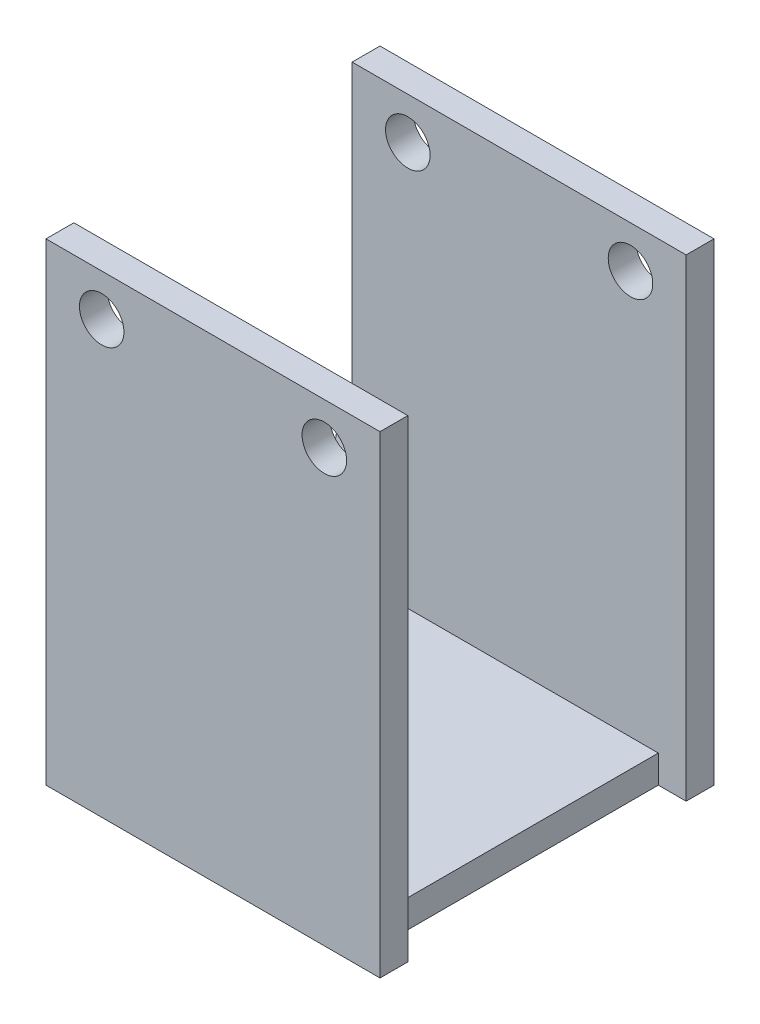
ISO-10303-21;
HEADER;
FILE_DESCRIPTION(('STEP AP214'),'2;1');
FILE_NAME('part.step','',(''),(''),'','','');
FILE_SCHEMA(('AUTOMOTIVE_DESIGN { 1 0 10303 214 1 1 1 1 }'));
ENDSEC;
DATA;
#1=APPLICATION_CONTEXT('core data for automotive mechanical design processes');
#2=APPLICATION_PROTOCOL_DEFINITION('international standard','automotive_design',2000,#1);
#3=PRODUCT_CONTEXT('',#1,'mechanical');
#4=PRODUCT('Part','Part','',(#3));
#5=PRODUCT_RELATED_PRODUCT_CATEGORY('part','',(#4));
#6=PRODUCT_DEFINITION_FORMATION('','',#4);
#7=PRODUCT_DEFINITION_CONTEXT('part definition',#1,'design');
#8=PRODUCT_DEFINITION('design','',#6,#7);
#9=PRODUCT_DEFINITION_SHAPE('','',#8);
#10=(LENGTH_UNIT() NAMED_UNIT(*) SI_UNIT(.MILLI.,.METRE.));
#11=(NAMED_UNIT(*) PLANE_ANGLE_UNIT() SI_UNIT($,.RADIAN.));
#12=(NAMED_UNIT(*) SI_UNIT($,.STERADIAN.) SOLID_ANGLE_UNIT());
#13=UNCERTAINTY_MEASURE_WITH_UNIT(LENGTH_MEASURE(1.E-05),#10,'distance_accuracy_value','');
#14=(GEOMETRIC_REPRESENTATION_CONTEXT(3) GLOBAL_UNCERTAINTY_ASSIGNED_CONTEXT((#13)) GLOBAL_UNIT_ASSIGNED_CONTEXT((#10,
#11,#12)) REPRESENTATION_CONTEXT('',''));
#15=CARTESIAN_POINT('',(0.,0.,0.));
#16=DIRECTION('',(0.,0.,1.));
#17=DIRECTION('',(1.,0.,0.));
#18=AXIS2_PLACEMENT_3D('',#15,#16,#17);
#19=CARTESIAN_POINT('',(0.,0.,1.));
#20=DIRECTION('',(0.,0.,-1.));
#21=DIRECTION('',(-1.,0.,0.));
#22=AXIS2_PLACEMENT_3D('',#19,#20,#21);
#23=PLANE('',#22);
#24=CARTESIAN_POINT('',(9.,15.5,1.));
#25=DIRECTION('',(0.,0.,-1.));
#26=DIRECTION('',(-1.,0.,0.));
#27=AXIS2_PLACEMENT_3D('',#24,#25,#26);
#28=CIRCLE('',#27,0.799999999999998);
#29=CARTESIAN_POINT('',(8.2,15.5,1.));
#30=VERTEX_POINT('',#29);
#31=EDGE_CURVE('E211',#30,#30,#28,.F.);
#32=ORIENTED_EDGE('',*,*,#31,.F.);
#33=EDGE_LOOP('',(#32));
#34=FACE_BOUND('',#33,.T.);
#35=DIRECTION('',(0.,-1.,0.));
#36=VECTOR('',#35,1.);
#37=CARTESIAN_POINT('',(-1.,0.,1.));
#38=LINE('',#37,#36);
#39=CARTESIAN_POINT('',(-1.,17.,1.));
#40=VERTEX_POINT('',#39);
#41=CARTESIAN_POINT('',(-1.,0.,1.));
#42=VERTEX_POINT('',#41);
#43=EDGE_CURVE('E226',#40,#42,#38,.T.);
#44=ORIENTED_EDGE('',*,*,#43,.T.);
#45=DIRECTION('',(1.,0.,0.));
#46=VECTOR('',#45,1.);
#47=CARTESIAN_POINT('',(-1.,0.,1.));
#48=LINE('',#47,#46);
#49=CARTESIAN_POINT('',(11.,0.,1.));
#50=VERTEX_POINT('',#49);
#51=EDGE_CURVE('E398',#42,#50,#48,.T.);
#52=ORIENTED_EDGE('',*,*,#51,.T.);
#53=DIRECTION('',(0.,1.,0.));
#54=VECTOR('',#53,1.);
#55=CARTESIAN_POINT('',(11.,0.,1.));
#56=LINE('',#55,#54);
#57=CARTESIAN_POINT('',(11.,17.,1.));
#58=VERTEX_POINT('',#57);
#59=EDGE_CURVE('E397',#50,#58,#56,.T.);
#60=ORIENTED_EDGE('',*,*,#59,.T.);
#61=DIRECTION('',(-1.,0.,0.));
#62=VECTOR('',#61,1.);
#63=CARTESIAN_POINT('',(-1.,17.,1.));
#64=LINE('',#63,#62);
#65=EDGE_CURVE('E373',#58,#40,#64,.T.);
#66=ORIENTED_EDGE('',*,*,#65,.T.);
#67=EDGE_LOOP('',(#44,#52,#60,#66));
#68=FACE_BOUND('',#67,.T.);
#69=CARTESIAN_POINT('',(1.,15.5,1.));
#70=DIRECTION('',(0.,0.,-1.));
#71=DIRECTION('',(-1.,0.,0.));
#72=AXIS2_PLACEMENT_3D('',#69,#70,#71);
#73=CIRCLE('',#72,0.799999999999998);
#74=CARTESIAN_POINT('',(0.200000000000003,15.5,1.));
#75=VERTEX_POINT('',#74);
#76=EDGE_CURVE('E202',#75,#75,#73,.F.);
#77=ORIENTED_EDGE('',*,*,#76,.F.);
#78=EDGE_LOOP('',(#77));
#79=FACE_BOUND('',#78,.T.);
#80=ADVANCED_FACE('F39',(#34,#68,#79),#23,.F.);
#81=CARTESIAN_POINT('',(10.,1.,0.));
#82=DIRECTION('',(-1.,0.,0.));
#83=DIRECTION('',(0.,0.,1.));
#84=AXIS2_PLACEMENT_3D('',#81,#82,#83);
#85=PLANE('',#84);
#86=DIRECTION('',(0.,0.,-1.));
#87=VECTOR('',#86,1.);
#88=CARTESIAN_POINT('',(10.,0.,0.));
#89=LINE('',#88,#87);
#90=CARTESIAN_POINT('',(10.,0.,0.));
#91=VERTEX_POINT('',#90);
#92=CARTESIAN_POINT('',(10.,0.,-10.));
#93=VERTEX_POINT('',#92);
#94=EDGE_CURVE('E292',#91,#93,#89,.T.);
#95=ORIENTED_EDGE('',*,*,#94,.T.);
#96=DIRECTION('',(0.,-1.,0.));
#97=VECTOR('',#96,1.);
#98=CARTESIAN_POINT('',(10.,1.,-10.));
#99=LINE('',#98,#97);
#100=CARTESIAN_POINT('',(10.,1.,-10.));
#101=VERTEX_POINT('',#100);
#102=EDGE_CURVE('E48',#101,#93,#99,.T.);
#103=ORIENTED_EDGE('',*,*,#102,.F.);
#104=DIRECTION('',(0.,0.,-1.));
#105=VECTOR('',#104,1.);
#106=CARTESIAN_POINT('',(10.,1.,0.));
#107=LINE('',#106,#105);
#108=CARTESIAN_POINT('',(10.,1.,0.));
#109=VERTEX_POINT('',#108);
#110=EDGE_CURVE('E56',#109,#101,#107,.T.);
#111=ORIENTED_EDGE('',*,*,#110,.F.);
#112=DIRECTION('',(0.,-1.,0.));
#113=VECTOR('',#112,1.);
#114=CARTESIAN_POINT('',(10.,1.,0.));
#115=LINE('',#114,#113);
#116=EDGE_CURVE('E11',#109,#91,#115,.T.);
#117=ORIENTED_EDGE('',*,*,#116,.T.);
#118=EDGE_LOOP('',(#95,#103,#111,#117));
#119=FACE_BOUND('',#118,.T.);
#120=ADVANCED_FACE('F41',(#119),#85,.F.);
#121=CARTESIAN_POINT('',(0.,1.,0.));
#122=DIRECTION('',(0.,-1.,0.));
#123=DIRECTION('',(0.,0.,-1.));
#124=AXIS2_PLACEMENT_3D('',#121,#122,#123);
#125=PLANE('',#124);
#126=DIRECTION('',(0.,0.,1.));
#127=VECTOR('',#126,1.);
#128=CARTESIAN_POINT('',(0.,1.,0.));
#129=LINE('',#128,#127);
#130=CARTESIAN_POINT('',(0.,0.999999999999999,-10.));
#131=VERTEX_POINT('',#130);
#132=CARTESIAN_POINT('',(0.,0.999999999999999,0.));
#133=VERTEX_POINT('',#132);
#134=EDGE_CURVE('E64',#131,#133,#129,.T.);
#135=ORIENTED_EDGE('',*,*,#134,.T.);
#136=DIRECTION('',(1.,0.,0.));
#137=VECTOR('',#136,1.);
#138=CARTESIAN_POINT('',(0.,1.,0.));
#139=LINE('',#138,#137);
#140=EDGE_CURVE('E299',#133,#109,#139,.T.);
#141=ORIENTED_EDGE('',*,*,#140,.T.);
#142=ORIENTED_EDGE('',*,*,#110,.T.);
#143=DIRECTION('',(-1.,0.,0.));
#144=VECTOR('',#143,1.);
#145=CARTESIAN_POINT('',(0.,1.,-10.));
#146=LINE('',#145,#144);
#147=EDGE_CURVE('E311',#101,#131,#146,.T.);
#148=ORIENTED_EDGE('',*,*,#147,.T.);
#149=EDGE_LOOP('',(#135,#141,#142,#148));
#150=FACE_BOUND('',#149,.T.);
#151=ADVANCED_FACE('F286',(#150),#125,.F.);
#152=CARTESIAN_POINT('',(0.,0.,0.));
#153=DIRECTION('',(0.,-1.,0.));
#154=DIRECTION('',(0.,0.,-1.));
#155=AXIS2_PLACEMENT_3D('',#152,#153,#154);
#156=PLANE('',#155);
#157=ORIENTED_EDGE('',*,*,#94,.F.);
#158=DIRECTION('',(1.,0.,0.));
#159=VECTOR('',#158,1.);
#160=CARTESIAN_POINT('',(-1.,0.,0.));
#161=LINE('',#160,#159);
#162=CARTESIAN_POINT('',(11.,0.,0.));
#163=VERTEX_POINT('',#162);
#164=EDGE_CURVE('E172',#91,#163,#161,.T.);
#165=ORIENTED_EDGE('',*,*,#164,.T.);
#166=DIRECTION('',(0.,0.,-1.));
#167=VECTOR('',#166,1.);
#168=CARTESIAN_POINT('',(11.,0.,1.));
#169=LINE('',#168,#167);
#170=EDGE_CURVE('E375',#50,#163,#169,.T.);
#171=ORIENTED_EDGE('',*,*,#170,.F.);
#172=ORIENTED_EDGE('',*,*,#51,.F.);
#173=DIRECTION('',(0.,0.,1.));
#174=VECTOR('',#173,1.);
#175=CARTESIAN_POINT('',(-1.,0.,0.));
#176=LINE('',#175,#174);
#177=CARTESIAN_POINT('',(-0.999999999999999,0.,-11.));
#178=VERTEX_POINT('',#177);
#179=EDGE_CURVE('E355',#178,#42,#176,.T.);
#180=ORIENTED_EDGE('',*,*,#179,.F.);
#181=DIRECTION('',(-1.,0.,0.));
#182=VECTOR('',#181,1.);
#183=CARTESIAN_POINT('',(11.,0.,-11.));
#184=LINE('',#183,#182);
#185=CARTESIAN_POINT('',(11.,0.,-11.));
#186=VERTEX_POINT('',#185);
#187=EDGE_CURVE('E161',#186,#178,#184,.T.);
#188=ORIENTED_EDGE('',*,*,#187,.F.);
#189=DIRECTION('',(0.,0.,1.));
#190=VECTOR('',#189,1.);
#191=CARTESIAN_POINT('',(11.,0.,-11.));
#192=LINE('',#191,#190);
#193=CARTESIAN_POINT('',(11.,0.,-10.));
#194=VERTEX_POINT('',#193);
#195=EDGE_CURVE('E174',#186,#194,#192,.T.);
#196=ORIENTED_EDGE('',*,*,#195,.T.);
#197=DIRECTION('',(-1.,0.,0.));
#198=VECTOR('',#197,1.);
#199=CARTESIAN_POINT('',(11.,0.,-10.));
#200=LINE('',#199,#198);
#201=EDGE_CURVE('E163',#194,#93,#200,.T.);
#202=ORIENTED_EDGE('',*,*,#201,.T.);
#203=EDGE_LOOP('',(#157,#165,#171,#172,#180,#188,#196,#202));
#204=FACE_BOUND('',#203,.T.);
#205=ADVANCED_FACE('F284',(#204),#156,.T.);
#206=CARTESIAN_POINT('',(-1.,6.5,0.));
#207=DIRECTION('',(0.,-1.,0.));
#208=DIRECTION('',(0.,0.,-1.));
#209=AXIS2_PLACEMENT_3D('',#206,#207,#208);
#210=PLANE('',#209);
#211=DIRECTION('',(0.,0.,-1.));
#212=VECTOR('',#211,1.);
#213=CARTESIAN_POINT('',(0.,6.5,0.));
#214=LINE('',#213,#212);
#215=CARTESIAN_POINT('',(0.,6.5,0.));
#216=VERTEX_POINT('',#215);
#217=CARTESIAN_POINT('',(0.,6.5,-0.5));
#218=VERTEX_POINT('',#217);
#219=EDGE_CURVE('E351',#216,#218,#214,.T.);
#220=ORIENTED_EDGE('',*,*,#219,.T.);
#221=DIRECTION('',(1.,0.,0.));
#222=VECTOR('',#221,1.);
#223=CARTESIAN_POINT('',(-1.,6.5,-0.5));
#224=LINE('',#223,#222);
#225=CARTESIAN_POINT('',(-1.,6.5,-0.5));
#226=VERTEX_POINT('',#225);
#227=EDGE_CURVE('E302',#226,#218,#224,.T.);
#228=ORIENTED_EDGE('',*,*,#227,.F.);
#229=DIRECTION('',(0.,0.,-1.));
#230=VECTOR('',#229,1.);
#231=CARTESIAN_POINT('',(-1.,6.5,0.));
#232=LINE('',#231,#230);
#233=CARTESIAN_POINT('',(-1.,6.5,0.));
#234=VERTEX_POINT('',#233);
#235=EDGE_CURVE('E329',#234,#226,#232,.T.);
#236=ORIENTED_EDGE('',*,*,#235,.F.);
#237=DIRECTION('',(1.,0.,0.));
#238=VECTOR('',#237,1.);
#239=CARTESIAN_POINT('',(-1.,6.5,0.));
#240=LINE('',#239,#238);
#241=EDGE_CURVE('E297',#234,#216,#240,.T.);
#242=ORIENTED_EDGE('',*,*,#241,.T.);
#243=EDGE_LOOP('',(#220,#228,#236,#242));
#244=FACE_BOUND('',#243,.T.);
#245=ADVANCED_FACE('F280',(#244),#210,.F.);
#246=CARTESIAN_POINT('',(-1.,6.5,-5.));
#247=DIRECTION('',(1.,0.,0.));
#248=DIRECTION('',(0.,0.,-1.));
#249=AXIS2_PLACEMENT_3D('',#246,#247,#248);
#250=CYLINDRICAL_SURFACE('',#249,4.5);
#251=CARTESIAN_POINT('',(0.,6.5,-5.));
#252=DIRECTION('',(1.,0.,0.));
#253=DIRECTION('',(0.,0.,1.));
#254=AXIS2_PLACEMENT_3D('',#251,#252,#253);
#255=CIRCLE('',#254,4.5);
#256=CARTESIAN_POINT('',(0.,6.5,-9.5));
#257=VERTEX_POINT('',#256);
#258=EDGE_CURVE('E346',#218,#257,#255,.T.);
#259=ORIENTED_EDGE('',*,*,#258,.T.);
#260=DIRECTION('',(1.,0.,0.));
#261=VECTOR('',#260,1.);
#262=CARTESIAN_POINT('',(-1.,6.5,-9.5));
#263=LINE('',#262,#261);
#264=CARTESIAN_POINT('',(-1.,6.5,-9.5));
#265=VERTEX_POINT('',#264);
#266=EDGE_CURVE('E338',#265,#257,#263,.T.);
#267=ORIENTED_EDGE('',*,*,#266,.F.);
#268=CARTESIAN_POINT('',(-1.,6.5,-5.));
#269=DIRECTION('',(1.,0.,0.));
#270=DIRECTION('',(0.,0.,1.));
#271=AXIS2_PLACEMENT_3D('',#268,#269,#270);
#272=CIRCLE('',#271,4.5);
#273=EDGE_CURVE('E347',#226,#265,#272,.T.);
#274=ORIENTED_EDGE('',*,*,#273,.F.);
#275=ORIENTED_EDGE('',*,*,#227,.T.);
#276=EDGE_LOOP('',(#259,#267,#274,#275));
#277=FACE_BOUND('',#276,.T.);
#278=ADVANCED_FACE('F276',(#277),#250,.F.);
#279=CARTESIAN_POINT('',(-1.,6.5,-9.5));
#280=DIRECTION('',(0.,-1.,0.));
#281=DIRECTION('',(0.,0.,-1.));
#282=AXIS2_PLACEMENT_3D('',#279,#280,#281);
#283=PLANE('',#282);
#284=DIRECTION('',(0.,0.,-1.));
#285=VECTOR('',#284,1.);
#286=CARTESIAN_POINT('',(0.,6.5,-9.5));
#287=LINE('',#286,#285);
#288=CARTESIAN_POINT('',(0.,6.5,-10.));
#289=VERTEX_POINT('',#288);
#290=EDGE_CURVE('E330',#257,#289,#287,.T.);
#291=ORIENTED_EDGE('',*,*,#290,.T.);
#292=DIRECTION('',(1.,0.,0.));
#293=VECTOR('',#292,1.);
#294=CARTESIAN_POINT('',(-1.,6.5,-10.));
#295=LINE('',#294,#293);
#296=CARTESIAN_POINT('',(-1.,6.5,-10.));
#297=VERTEX_POINT('',#296);
#298=EDGE_CURVE('E340',#297,#289,#295,.T.);
#299=ORIENTED_EDGE('',*,*,#298,.F.);
#300=DIRECTION('',(0.,0.,-1.));
#301=VECTOR('',#300,1.);
#302=CARTESIAN_POINT('',(-1.,6.5,-9.5));
#303=LINE('',#302,#301);
#304=EDGE_CURVE('E312',#265,#297,#303,.T.);
#305=ORIENTED_EDGE('',*,*,#304,.F.);
#306=ORIENTED_EDGE('',*,*,#266,.T.);
#307=EDGE_LOOP('',(#291,#299,#305,#306));
#308=FACE_BOUND('',#307,.T.);
#309=ADVANCED_FACE('F271',(#308),#283,.F.);
#310=CARTESIAN_POINT('',(-1.,6.5,-5.));
#311=DIRECTION('',(-1.,0.,0.));
#312=DIRECTION('',(0.,0.,1.));
#313=AXIS2_PLACEMENT_3D('',#310,#311,#312);
#314=PLANE('',#313);
#315=ORIENTED_EDGE('',*,*,#179,.T.);
#316=ORIENTED_EDGE('',*,*,#43,.F.);
#317=DIRECTION('',(0.,0.,-1.));
#318=VECTOR('',#317,1.);
#319=CARTESIAN_POINT('',(-1.,17.,1.));
#320=LINE('',#319,#318);
#321=CARTESIAN_POINT('',(-1.,17.,0.));
#322=VERTEX_POINT('',#321);
#323=EDGE_CURVE('E369',#40,#322,#320,.T.);
#324=ORIENTED_EDGE('',*,*,#323,.T.);
#325=DIRECTION('',(0.,-1.,0.));
#326=VECTOR('',#325,1.);
#327=CARTESIAN_POINT('',(-1.,0.,0.));
#328=LINE('',#327,#326);
#329=EDGE_CURVE('E169',#322,#234,#328,.T.);
#330=ORIENTED_EDGE('',*,*,#329,.T.);
#331=ORIENTED_EDGE('',*,*,#235,.T.);
#332=ORIENTED_EDGE('',*,*,#273,.T.);
#333=ORIENTED_EDGE('',*,*,#304,.T.);
#334=DIRECTION('',(0.,1.,0.));
#335=VECTOR('',#334,1.);
#336=CARTESIAN_POINT('',(-0.999999999999999,0.,-10.));
#337=LINE('',#336,#335);
#338=CARTESIAN_POINT('',(-0.999999999999999,17.,-10.));
#339=VERTEX_POINT('',#338);
#340=EDGE_CURVE('E167',#297,#339,#337,.T.);
#341=ORIENTED_EDGE('',*,*,#340,.T.);
#342=DIRECTION('',(0.,0.,1.));
#343=VECTOR('',#342,1.);
#344=CARTESIAN_POINT('',(-0.999999999999999,17.,-11.));
#345=LINE('',#344,#343);
#346=CARTESIAN_POINT('',(-0.999999999999999,17.,-11.));
#347=VERTEX_POINT('',#346);
#348=EDGE_CURVE('E149',#347,#339,#345,.T.);
#349=ORIENTED_EDGE('',*,*,#348,.F.);
#350=DIRECTION('',(0.,1.,0.));
#351=VECTOR('',#350,1.);
#352=CARTESIAN_POINT('',(-0.999999999999999,0.,-11.));
#353=LINE('',#352,#351);
#354=EDGE_CURVE('E155',#178,#347,#353,.T.);
#355=ORIENTED_EDGE('',*,*,#354,.F.);
#356=EDGE_LOOP('',(#315,#316,#324,#330,#331,#332,#333,#341,#349,#355));
#357=FACE_BOUND('',#356,.T.);
#358=ADVANCED_FACE('F165',(#357),#314,.T.);
#359=CARTESIAN_POINT('',(0.,6.5,-5.));
#360=DIRECTION('',(-1.,0.,0.));
#361=DIRECTION('',(0.,0.,1.));
#362=AXIS2_PLACEMENT_3D('',#359,#360,#361);
#363=PLANE('',#362);
#364=ORIENTED_EDGE('',*,*,#134,.F.);
#365=DIRECTION('',(0.,-1.,0.));
#366=VECTOR('',#365,1.);
#367=CARTESIAN_POINT('',(0.,0.,-10.));
#368=LINE('',#367,#366);
#369=EDGE_CURVE('E325',#289,#131,#368,.T.);
#370=ORIENTED_EDGE('',*,*,#369,.F.);
#371=ORIENTED_EDGE('',*,*,#290,.F.);
#372=ORIENTED_EDGE('',*,*,#258,.F.);
#373=ORIENTED_EDGE('',*,*,#219,.F.);
#374=DIRECTION('',(0.,1.,0.));
#375=VECTOR('',#374,1.);
#376=CARTESIAN_POINT('',(0.,0.,0.));
#377=LINE('',#376,#375);
#378=EDGE_CURVE('E331',#133,#216,#377,.T.);
#379=ORIENTED_EDGE('',*,*,#378,.F.);
#380=EDGE_LOOP('',(#364,#370,#371,#372,#373,#379));
#381=FACE_BOUND('',#380,.T.);
#382=ADVANCED_FACE('F261',(#381),#363,.F.);
#383=CARTESIAN_POINT('',(0.,0.,0.));
#384=DIRECTION('',(0.,0.,-1.));
#385=DIRECTION('',(-1.,0.,0.));
#386=AXIS2_PLACEMENT_3D('',#383,#384,#385);
#387=PLANE('',#386);
#388=CARTESIAN_POINT('',(9.,15.5,0.));
#389=DIRECTION('',(0.,0.,-1.));
#390=DIRECTION('',(-1.,0.,0.));
#391=AXIS2_PLACEMENT_3D('',#388,#389,#390);
#392=CIRCLE('',#391,0.799999999999998);
#393=CARTESIAN_POINT('',(8.2,15.5,0.));
#394=VERTEX_POINT('',#393);
#395=EDGE_CURVE('E203',#394,#394,#392,.T.);
#396=ORIENTED_EDGE('',*,*,#395,.F.);
#397=EDGE_LOOP('',(#396));
#398=FACE_BOUND('',#397,.T.);
#399=CARTESIAN_POINT('',(1.,15.5,0.));
#400=DIRECTION('',(0.,0.,-1.));
#401=DIRECTION('',(-1.,0.,0.));
#402=AXIS2_PLACEMENT_3D('',#399,#400,#401);
#403=CIRCLE('',#402,0.799999999999998);
#404=CARTESIAN_POINT('',(0.200000000000003,15.5,0.));
#405=VERTEX_POINT('',#404);
#406=EDGE_CURVE('E181',#405,#405,#403,.T.);
#407=ORIENTED_EDGE('',*,*,#406,.F.);
#408=EDGE_LOOP('',(#407));
#409=FACE_BOUND('',#408,.T.);
#410=ORIENTED_EDGE('',*,*,#116,.F.);
#411=ORIENTED_EDGE('',*,*,#140,.F.);
#412=ORIENTED_EDGE('',*,*,#378,.T.);
#413=ORIENTED_EDGE('',*,*,#241,.F.);
#414=ORIENTED_EDGE('',*,*,#329,.F.);
#415=DIRECTION('',(-1.,0.,0.));
#416=VECTOR('',#415,1.);
#417=CARTESIAN_POINT('',(-1.,17.,0.));
#418=LINE('',#417,#416);
#419=CARTESIAN_POINT('',(11.,17.,0.));
#420=VERTEX_POINT('',#419);
#421=EDGE_CURVE('E367',#420,#322,#418,.T.);
#422=ORIENTED_EDGE('',*,*,#421,.F.);
#423=DIRECTION('',(0.,1.,0.));
#424=VECTOR('',#423,1.);
#425=CARTESIAN_POINT('',(11.,0.,0.));
#426=LINE('',#425,#424);
#427=EDGE_CURVE('E359',#163,#420,#426,.T.);
#428=ORIENTED_EDGE('',*,*,#427,.F.);
#429=ORIENTED_EDGE('',*,*,#164,.F.);
#430=EDGE_LOOP('',(#410,#411,#412,#413,#414,#422,#428,#429));
#431=FACE_BOUND('',#430,.T.);
#432=ADVANCED_FACE('F257',(#398,#409,#431),#387,.T.);
#433=CARTESIAN_POINT('',(11.,0.,1.));
#434=DIRECTION('',(-1.,0.,0.));
#435=DIRECTION('',(0.,0.,1.));
#436=AXIS2_PLACEMENT_3D('',#433,#434,#435);
#437=PLANE('',#436);
#438=ORIENTED_EDGE('',*,*,#427,.T.);
#439=DIRECTION('',(0.,0.,-1.));
#440=VECTOR('',#439,1.);
#441=CARTESIAN_POINT('',(11.,17.,1.));
#442=LINE('',#441,#440);
#443=EDGE_CURVE('E372',#58,#420,#442,.T.);
#444=ORIENTED_EDGE('',*,*,#443,.F.);
#445=ORIENTED_EDGE('',*,*,#59,.F.);
#446=ORIENTED_EDGE('',*,*,#170,.T.);
#447=EDGE_LOOP('',(#438,#444,#445,#446));
#448=FACE_BOUND('',#447,.T.);
#449=ADVANCED_FACE('F260',(#448),#437,.F.);
#450=CARTESIAN_POINT('',(-1.,17.,1.));
#451=DIRECTION('',(0.,-1.,0.));
#452=DIRECTION('',(0.,0.,-1.));
#453=AXIS2_PLACEMENT_3D('',#450,#451,#452);
#454=PLANE('',#453);
#455=ORIENTED_EDGE('',*,*,#421,.T.);
#456=ORIENTED_EDGE('',*,*,#323,.F.);
#457=ORIENTED_EDGE('',*,*,#65,.F.);
#458=ORIENTED_EDGE('',*,*,#443,.T.);
#459=EDGE_LOOP('',(#455,#456,#457,#458));
#460=FACE_BOUND('',#459,.T.);
#461=ADVANCED_FACE('F250',(#460),#454,.F.);
#462=CARTESIAN_POINT('',(0.,0.,-10.));
#463=DIRECTION('',(0.,0.,-1.));
#464=DIRECTION('',(-1.,0.,0.));
#465=AXIS2_PLACEMENT_3D('',#462,#463,#464);
#466=PLANE('',#465);
#467=CARTESIAN_POINT('',(9.,15.5,-10.));
#468=DIRECTION('',(0.,0.,-1.));
#469=DIRECTION('',(-1.,0.,0.));
#470=AXIS2_PLACEMENT_3D('',#467,#468,#469);
#471=CIRCLE('',#470,0.799999999999998);
#472=CARTESIAN_POINT('',(8.2,15.5,-10.));
#473=VERTEX_POINT('',#472);
#474=EDGE_CURVE('E208',#473,#473,#471,.T.);
#475=ORIENTED_EDGE('',*,*,#474,.T.);
#476=EDGE_LOOP('',(#475));
#477=FACE_BOUND('',#476,.T.);
#478=CARTESIAN_POINT('',(1.,15.5,-10.));
#479=DIRECTION('',(0.,0.,-1.));
#480=DIRECTION('',(-1.,0.,0.));
#481=AXIS2_PLACEMENT_3D('',#478,#479,#480);
#482=CIRCLE('',#481,0.799999999999998);
#483=CARTESIAN_POINT('',(0.200000000000003,15.5,-10.));
#484=VERTEX_POINT('',#483);
#485=EDGE_CURVE('E43',#484,#484,#482,.T.);
#486=ORIENTED_EDGE('',*,*,#485,.T.);
#487=EDGE_LOOP('',(#486));
#488=FACE_BOUND('',#487,.T.);
#489=ORIENTED_EDGE('',*,*,#340,.F.);
#490=ORIENTED_EDGE('',*,*,#298,.T.);
#491=ORIENTED_EDGE('',*,*,#369,.T.);
#492=ORIENTED_EDGE('',*,*,#147,.F.);
#493=ORIENTED_EDGE('',*,*,#102,.T.);
#494=ORIENTED_EDGE('',*,*,#201,.F.);
#495=DIRECTION('',(0.,-1.,0.));
#496=VECTOR('',#495,1.);
#497=CARTESIAN_POINT('',(11.,17.,-10.));
#498=LINE('',#497,#496);
#499=CARTESIAN_POINT('',(11.,17.,-10.));
#500=VERTEX_POINT('',#499);
#501=EDGE_CURVE('E189',#500,#194,#498,.T.);
#502=ORIENTED_EDGE('',*,*,#501,.F.);
#503=DIRECTION('',(1.,0.,0.));
#504=VECTOR('',#503,1.);
#505=CARTESIAN_POINT('',(-0.999999999999999,17.,-10.));
#506=LINE('',#505,#504);
#507=EDGE_CURVE('E180',#339,#500,#506,.T.);
#508=ORIENTED_EDGE('',*,*,#507,.F.);
#509=EDGE_LOOP('',(#489,#490,#491,#492,#493,#494,#502,#508));
#510=FACE_BOUND('',#509,.T.);
#511=ADVANCED_FACE('F247',(#477,#488,#510),#466,.F.);
#512=CARTESIAN_POINT('',(-0.999999999999999,17.,-11.));
#513=DIRECTION('',(0.,-1.,0.));
#514=DIRECTION('',(0.,0.,-1.));
#515=AXIS2_PLACEMENT_3D('',#512,#513,#514);
#516=PLANE('',#515);
#517=ORIENTED_EDGE('',*,*,#507,.T.);
#518=DIRECTION('',(0.,0.,1.));
#519=VECTOR('',#518,1.);
#520=CARTESIAN_POINT('',(11.,17.,-11.));
#521=LINE('',#520,#519);
#522=CARTESIAN_POINT('',(11.,17.,-11.));
#523=VERTEX_POINT('',#522);
#524=EDGE_CURVE('E151',#523,#500,#521,.T.);
#525=ORIENTED_EDGE('',*,*,#524,.F.);
#526=DIRECTION('',(1.,0.,0.));
#527=VECTOR('',#526,1.);
#528=CARTESIAN_POINT('',(-0.999999999999999,17.,-11.));
#529=LINE('',#528,#527);
#530=EDGE_CURVE('E145',#347,#523,#529,.T.);
#531=ORIENTED_EDGE('',*,*,#530,.F.);
#532=ORIENTED_EDGE('',*,*,#348,.T.);
#533=EDGE_LOOP('',(#517,#525,#531,#532));
#534=FACE_BOUND('',#533,.T.);
#535=ADVANCED_FACE('F147',(#534),#516,.F.);
#536=CARTESIAN_POINT('',(11.,17.,-11.));
#537=DIRECTION('',(-1.,0.,0.));
#538=DIRECTION('',(0.,0.,1.));
#539=AXIS2_PLACEMENT_3D('',#536,#537,#538);
#540=PLANE('',#539);
#541=ORIENTED_EDGE('',*,*,#501,.T.);
#542=ORIENTED_EDGE('',*,*,#195,.F.);
#543=DIRECTION('',(0.,-1.,0.));
#544=VECTOR('',#543,1.);
#545=CARTESIAN_POINT('',(11.,17.,-11.));
#546=LINE('',#545,#544);
#547=EDGE_CURVE('E154',#523,#186,#546,.T.);
#548=ORIENTED_EDGE('',*,*,#547,.F.);
#549=ORIENTED_EDGE('',*,*,#524,.T.);
#550=EDGE_LOOP('',(#541,#542,#548,#549));
#551=FACE_BOUND('',#550,.T.);
#552=ADVANCED_FACE('F245',(#551),#540,.F.);
#553=CARTESIAN_POINT('',(0.,0.,-11.));
#554=DIRECTION('',(0.,0.,-1.));
#555=DIRECTION('',(-1.,0.,0.));
#556=AXIS2_PLACEMENT_3D('',#553,#554,#555);
#557=PLANE('',#556);
#558=CARTESIAN_POINT('',(9.,15.5,-11.));
#559=DIRECTION('',(0.,0.,-1.));
#560=DIRECTION('',(-1.,0.,0.));
#561=AXIS2_PLACEMENT_3D('',#558,#559,#560);
#562=CIRCLE('',#561,0.799999999999999);
#563=CARTESIAN_POINT('',(8.2,15.5,-11.));
#564=VERTEX_POINT('',#563);
#565=EDGE_CURVE('E212',#564,#564,#562,.T.);
#566=ORIENTED_EDGE('',*,*,#565,.F.);
#567=EDGE_LOOP('',(#566));
#568=FACE_BOUND('',#567,.T.);
#569=CARTESIAN_POINT('',(1.,15.5,-11.));
#570=DIRECTION('',(0.,0.,-1.));
#571=DIRECTION('',(-1.,0.,0.));
#572=AXIS2_PLACEMENT_3D('',#569,#570,#571);
#573=CIRCLE('',#572,0.799999999999999);
#574=CARTESIAN_POINT('',(0.200000000000002,15.5,-11.));
#575=VERTEX_POINT('',#574);
#576=EDGE_CURVE('E199',#575,#575,#573,.T.);
#577=ORIENTED_EDGE('',*,*,#576,.F.);
#578=EDGE_LOOP('',(#577));
#579=FACE_BOUND('',#578,.T.);
#580=ORIENTED_EDGE('',*,*,#354,.T.);
#581=ORIENTED_EDGE('',*,*,#530,.T.);
#582=ORIENTED_EDGE('',*,*,#547,.T.);
#583=ORIENTED_EDGE('',*,*,#187,.T.);
#584=EDGE_LOOP('',(#580,#581,#582,#583));
#585=FACE_BOUND('',#584,.T.);
#586=ADVANCED_FACE('F159',(#568,#579,#585),#557,.T.);
#587=CARTESIAN_POINT('',(1.,15.5,-11.));
#588=DIRECTION('',(0.,0.,-1.));
#589=DIRECTION('',(-1.,0.,0.));
#590=AXIS2_PLACEMENT_3D('',#587,#588,#589);
#591=CYLINDRICAL_SURFACE('',#590,0.799999999999998);
#592=ORIENTED_EDGE('',*,*,#576,.T.);
#593=EDGE_LOOP('',(#592));
#594=FACE_BOUND('',#593,.T.);
#595=ORIENTED_EDGE('',*,*,#485,.F.);
#596=EDGE_LOOP('',(#595));
#597=FACE_BOUND('',#596,.T.);
#598=ADVANCED_FACE('F232',(#594,#597),#591,.F.);
#599=ORIENTED_EDGE('',*,*,#406,.T.);
#600=EDGE_LOOP('',(#599));
#601=FACE_BOUND('',#600,.T.);
#602=ORIENTED_EDGE('',*,*,#76,.T.);
#603=EDGE_LOOP('',(#602));
#604=FACE_BOUND('',#603,.T.);
#605=ADVANCED_FACE('F229',(#601,#604),#591,.F.);
#606=CARTESIAN_POINT('',(9.,15.5,-11.));
#607=DIRECTION('',(0.,0.,-1.));
#608=DIRECTION('',(-1.,0.,0.));
#609=AXIS2_PLACEMENT_3D('',#606,#607,#608);
#610=CYLINDRICAL_SURFACE('',#609,0.799999999999998);
#611=ORIENTED_EDGE('',*,*,#565,.T.);
#612=EDGE_LOOP('',(#611));
#613=FACE_BOUND('',#612,.T.);
#614=ORIENTED_EDGE('',*,*,#474,.F.);
#615=EDGE_LOOP('',(#614));
#616=FACE_BOUND('',#615,.T.);
#617=ADVANCED_FACE('F231',(#613,#616),#610,.F.);
#618=ORIENTED_EDGE('',*,*,#395,.T.);
#619=EDGE_LOOP('',(#618));
#620=FACE_BOUND('',#619,.T.);
#621=ORIENTED_EDGE('',*,*,#31,.T.);
#622=EDGE_LOOP('',(#621));
#623=FACE_BOUND('',#622,.T.);
#624=ADVANCED_FACE('F218',(#620,#623),#610,.F.);
#625=CLOSED_SHELL('',(#80,#120,#151,#205,#245,#278,#309,#358,#382,#432,#449,#461,#511,#535,#552,
#586,#598,#605,#617,#624));
#626=MANIFOLD_SOLID_BREP('B2',#625);
#627=ADVANCED_BREP_SHAPE_REPRESENTATION('',(#18,#626),#14);
#628=SHAPE_DEFINITION_REPRESENTATION(#9,#627);
ENDSEC;
END-ISO-10303-21;
